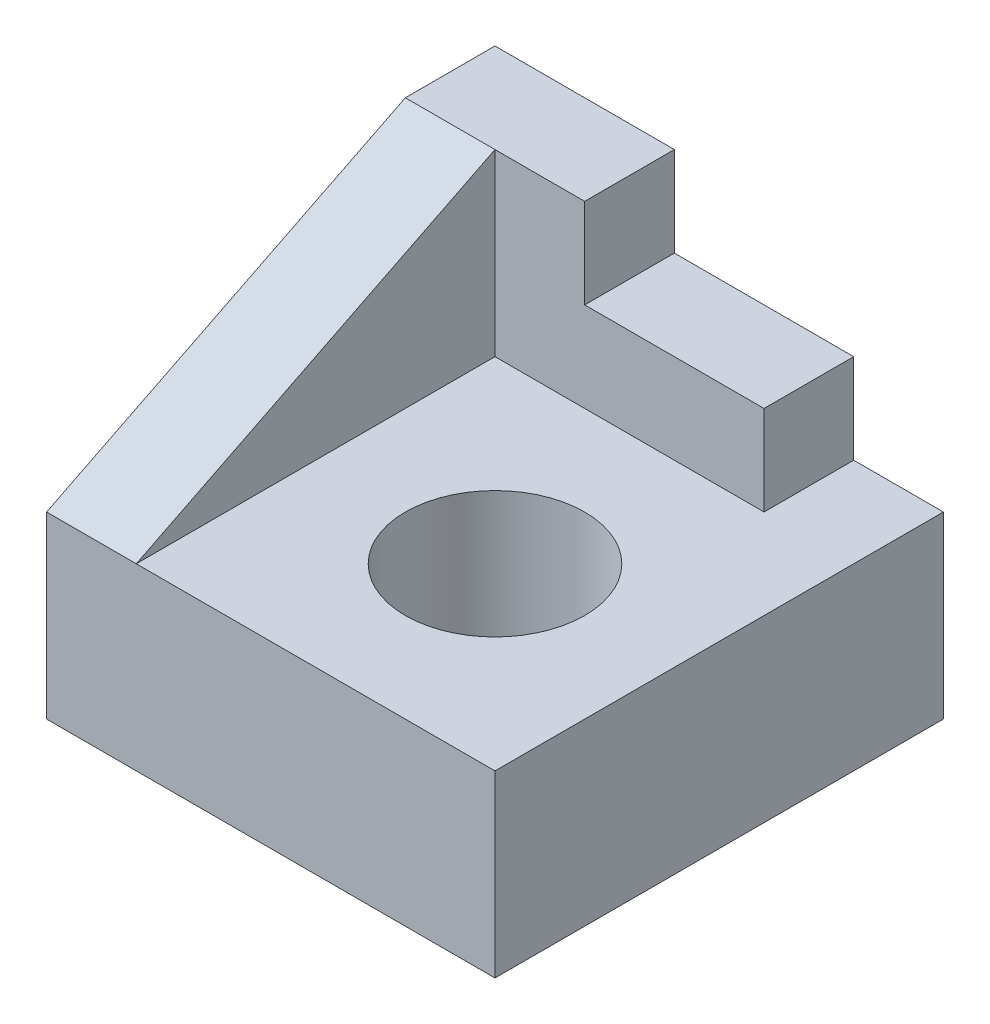
ISO-10303-21;
HEADER;
FILE_DESCRIPTION(('STEP AP214'),'2;1');
FILE_NAME('part.step','',(''),(''),'','','');
FILE_SCHEMA(('AUTOMOTIVE_DESIGN { 1 0 10303 214 1 1 1 1 }'));
ENDSEC;
DATA;
#1=APPLICATION_CONTEXT('core data for automotive mechanical design processes');
#2=APPLICATION_PROTOCOL_DEFINITION('international standard','automotive_design',2000,#1);
#3=PRODUCT_CONTEXT('',#1,'mechanical');
#4=PRODUCT('Part','Part','',(#3));
#5=PRODUCT_RELATED_PRODUCT_CATEGORY('part','',(#4));
#6=PRODUCT_DEFINITION_FORMATION('','',#4);
#7=PRODUCT_DEFINITION_CONTEXT('part definition',#1,'design');
#8=PRODUCT_DEFINITION('design','',#6,#7);
#9=PRODUCT_DEFINITION_SHAPE('','',#8);
#10=(LENGTH_UNIT() NAMED_UNIT(*) SI_UNIT(.MILLI.,.METRE.));
#11=(NAMED_UNIT(*) PLANE_ANGLE_UNIT() SI_UNIT($,.RADIAN.));
#12=(NAMED_UNIT(*) SI_UNIT($,.STERADIAN.) SOLID_ANGLE_UNIT());
#13=UNCERTAINTY_MEASURE_WITH_UNIT(LENGTH_MEASURE(1.E-05),#10,'distance_accuracy_value','');
#14=(GEOMETRIC_REPRESENTATION_CONTEXT(3) GLOBAL_UNCERTAINTY_ASSIGNED_CONTEXT((#13)) GLOBAL_UNIT_ASSIGNED_CONTEXT((#10,
#11,#12)) REPRESENTATION_CONTEXT('',''));
#15=CARTESIAN_POINT('',(0.,0.,0.));
#16=DIRECTION('',(0.,0.,1.));
#17=DIRECTION('',(1.,0.,0.));
#18=AXIS2_PLACEMENT_3D('',#15,#16,#17);
#19=CARTESIAN_POINT('',(0.,10.,10.));
#20=DIRECTION('',(0.,0.,-1.));
#21=DIRECTION('',(-1.,0.,0.));
#22=AXIS2_PLACEMENT_3D('',#19,#20,#21);
#23=PLANE('',#22);
#24=DIRECTION('',(1.,0.,0.));
#25=VECTOR('',#24,1.);
#26=CARTESIAN_POINT('',(0.,10.,10.));
#27=LINE('',#26,#25);
#28=CARTESIAN_POINT('',(-10.,10.,10.));
#29=VERTEX_POINT('',#28);
#30=CARTESIAN_POINT('',(10.,10.,10.));
#31=VERTEX_POINT('',#30);
#32=EDGE_CURVE('E138',#29,#31,#27,.T.);
#33=ORIENTED_EDGE('',*,*,#32,.F.);
#34=DIRECTION('',(1.,0.,0.));
#35=VECTOR('',#34,1.);
#36=CARTESIAN_POINT('',(-30.,10.,10.));
#37=LINE('',#36,#35);
#38=CARTESIAN_POINT('',(-15.,10.,10.));
#39=VERTEX_POINT('',#38);
#40=EDGE_CURVE('E119',#39,#29,#37,.T.);
#41=ORIENTED_EDGE('',*,*,#40,.F.);
#42=DIRECTION('',(0.,-1.,0.));
#43=VECTOR('',#42,1.);
#44=CARTESIAN_POINT('',(-15.,20.,10.));
#45=LINE('',#44,#43);
#46=CARTESIAN_POINT('',(-15.,0.,10.));
#47=VERTEX_POINT('',#46);
#48=EDGE_CURVE('E194',#39,#47,#45,.T.);
#49=ORIENTED_EDGE('',*,*,#48,.T.);
#50=DIRECTION('',(1.,0.,0.));
#51=VECTOR('',#50,1.);
#52=CARTESIAN_POINT('',(0.,0.,10.));
#53=LINE('',#52,#51);
#54=CARTESIAN_POINT('',(10.,0.,10.));
#55=VERTEX_POINT('',#54);
#56=EDGE_CURVE('E158',#47,#55,#53,.T.);
#57=ORIENTED_EDGE('',*,*,#56,.T.);
#58=DIRECTION('',(0.,-1.,0.));
#59=VECTOR('',#58,1.);
#60=CARTESIAN_POINT('',(10.,10.,10.));
#61=LINE('',#60,#59);
#62=EDGE_CURVE('E48',#31,#55,#61,.T.);
#63=ORIENTED_EDGE('',*,*,#62,.F.);
#64=EDGE_LOOP('',(#33,#41,#49,#57,#63));
#65=FACE_BOUND('',#64,.T.);
#66=ADVANCED_FACE('F39',(#65),#23,.F.);
#67=CARTESIAN_POINT('',(10.,10.,0.));
#68=DIRECTION('',(1.,0.,0.));
#69=DIRECTION('',(0.,0.,-1.));
#70=AXIS2_PLACEMENT_3D('',#67,#68,#69);
#71=PLANE('',#70);
#72=DIRECTION('',(0.,0.,1.));
#73=VECTOR('',#72,1.);
#74=CARTESIAN_POINT('',(10.,0.,0.));
#75=LINE('',#74,#73);
#76=CARTESIAN_POINT('',(10.,0.,-15.));
#77=VERTEX_POINT('',#76);
#78=EDGE_CURVE('E161',#77,#55,#75,.T.);
#79=ORIENTED_EDGE('',*,*,#78,.F.);
#80=DIRECTION('',(0.,-1.,0.));
#81=VECTOR('',#80,1.);
#82=CARTESIAN_POINT('',(10.,10.,-15.));
#83=LINE('',#82,#81);
#84=CARTESIAN_POINT('',(10.,10.,-15.));
#85=VERTEX_POINT('',#84);
#86=EDGE_CURVE('E56',#85,#77,#83,.T.);
#87=ORIENTED_EDGE('',*,*,#86,.F.);
#88=DIRECTION('',(0.,0.,1.));
#89=VECTOR('',#88,1.);
#90=CARTESIAN_POINT('',(10.,10.,0.));
#91=LINE('',#90,#89);
#92=EDGE_CURVE('E140',#85,#31,#91,.T.);
#93=ORIENTED_EDGE('',*,*,#92,.T.);
#94=ORIENTED_EDGE('',*,*,#62,.T.);
#95=EDGE_LOOP('',(#79,#87,#93,#94));
#96=FACE_BOUND('',#95,.T.);
#97=ADVANCED_FACE('F172',(#96),#71,.T.);
#98=CARTESIAN_POINT('',(0.,10.,-15.));
#99=DIRECTION('',(0.,0.,-1.));
#100=DIRECTION('',(-1.,0.,0.));
#101=AXIS2_PLACEMENT_3D('',#98,#99,#100);
#102=PLANE('',#101);
#103=DIRECTION('',(1.,0.,0.));
#104=VECTOR('',#103,1.);
#105=CARTESIAN_POINT('',(0.,0.,-15.));
#106=LINE('',#105,#104);
#107=CARTESIAN_POINT('',(-15.,0.,-15.));
#108=VERTEX_POINT('',#107);
#109=EDGE_CURVE('E164',#108,#77,#106,.T.);
#110=ORIENTED_EDGE('',*,*,#109,.F.);
#111=DIRECTION('',(0.,-1.,0.));
#112=VECTOR('',#111,1.);
#113=CARTESIAN_POINT('',(-15.,20.,-15.));
#114=LINE('',#113,#112);
#115=CARTESIAN_POINT('',(-15.,20.,-15.));
#116=VERTEX_POINT('',#115);
#117=EDGE_CURVE('E196',#116,#108,#114,.T.);
#118=ORIENTED_EDGE('',*,*,#117,.F.);
#119=DIRECTION('',(1.,0.,0.));
#120=VECTOR('',#119,1.);
#121=CARTESIAN_POINT('',(0.,20.,-15.));
#122=LINE('',#121,#120);
#123=CARTESIAN_POINT('',(-5.,20.,-15.));
#124=VERTEX_POINT('',#123);
#125=EDGE_CURVE('E184',#116,#124,#122,.T.);
#126=ORIENTED_EDGE('',*,*,#125,.T.);
#127=DIRECTION('',(0.,-1.,0.));
#128=VECTOR('',#127,1.);
#129=CARTESIAN_POINT('',(-5.,20.,-15.));
#130=LINE('',#129,#128);
#131=CARTESIAN_POINT('',(-5.,15.,-15.));
#132=VERTEX_POINT('',#131);
#133=EDGE_CURVE('E198',#124,#132,#130,.T.);
#134=ORIENTED_EDGE('',*,*,#133,.T.);
#135=DIRECTION('',(1.,0.,0.));
#136=VECTOR('',#135,1.);
#137=CARTESIAN_POINT('',(0.,15.,-15.));
#138=LINE('',#137,#136);
#139=CARTESIAN_POINT('',(5.,15.,-15.));
#140=VERTEX_POINT('',#139);
#141=EDGE_CURVE('E206',#132,#140,#138,.T.);
#142=ORIENTED_EDGE('',*,*,#141,.T.);
#143=DIRECTION('',(0.,-1.,0.));
#144=VECTOR('',#143,1.);
#145=CARTESIAN_POINT('',(5.,15.,-15.));
#146=LINE('',#145,#144);
#147=CARTESIAN_POINT('',(5.,10.,-15.));
#148=VERTEX_POINT('',#147);
#149=EDGE_CURVE('E212',#140,#148,#146,.T.);
#150=ORIENTED_EDGE('',*,*,#149,.T.);
#151=DIRECTION('',(1.,0.,0.));
#152=VECTOR('',#151,1.);
#153=CARTESIAN_POINT('',(0.,10.,-15.));
#154=LINE('',#153,#152);
#155=EDGE_CURVE('E150',#148,#85,#154,.T.);
#156=ORIENTED_EDGE('',*,*,#155,.T.);
#157=ORIENTED_EDGE('',*,*,#86,.T.);
#158=EDGE_LOOP('',(#110,#118,#126,#134,#142,#150,#156,#157));
#159=FACE_BOUND('',#158,.T.);
#160=ADVANCED_FACE('F168',(#159),#102,.T.);
#161=CARTESIAN_POINT('',(0.,10.,0.));
#162=DIRECTION('',(0.,-1.,0.));
#163=DIRECTION('',(0.,0.,-1.));
#164=AXIS2_PLACEMENT_3D('',#161,#162,#163);
#165=CYLINDRICAL_SURFACE('',#164,5.);
#166=CARTESIAN_POINT('',(0.,10.,0.));
#167=DIRECTION('',(0.,1.,0.));
#168=DIRECTION('',(0.,0.,1.));
#169=AXIS2_PLACEMENT_3D('',#166,#167,#168);
#170=CIRCLE('',#169,5.);
#171=CARTESIAN_POINT('',(0.,10.,5.));
#172=VERTEX_POINT('',#171);
#173=EDGE_CURVE('E145',#172,#172,#170,.T.);
#174=ORIENTED_EDGE('',*,*,#173,.T.);
#175=EDGE_LOOP('',(#174));
#176=FACE_BOUND('',#175,.T.);
#177=CARTESIAN_POINT('',(0.,0.,0.));
#178=DIRECTION('',(0.,1.,0.));
#179=DIRECTION('',(0.,0.,1.));
#180=AXIS2_PLACEMENT_3D('',#177,#178,#179);
#181=CIRCLE('',#180,5.);
#182=CARTESIAN_POINT('',(0.,0.,5.));
#183=VERTEX_POINT('',#182);
#184=EDGE_CURVE('E155',#183,#183,#181,.T.);
#185=ORIENTED_EDGE('',*,*,#184,.F.);
#186=EDGE_LOOP('',(#185));
#187=FACE_BOUND('',#186,.T.);
#188=ADVANCED_FACE('F41',(#176,#187),#165,.F.);
#189=CARTESIAN_POINT('',(0.,10.,0.));
#190=DIRECTION('',(0.,1.,0.));
#191=DIRECTION('',(0.,0.,1.));
#192=AXIS2_PLACEMENT_3D('',#189,#190,#191);
#193=PLANE('',#192);
#194=ORIENTED_EDGE('',*,*,#173,.F.);
#195=EDGE_LOOP('',(#194));
#196=FACE_BOUND('',#195,.T.);
#197=DIRECTION('',(1.,0.,0.));
#198=VECTOR('',#197,1.);
#199=CARTESIAN_POINT('',(0.,10.,-10.));
#200=LINE('',#199,#198);
#201=CARTESIAN_POINT('',(-10.,10.,-10.));
#202=VERTEX_POINT('',#201);
#203=CARTESIAN_POINT('',(5.,10.,-10.));
#204=VERTEX_POINT('',#203);
#205=EDGE_CURVE('E72',#202,#204,#200,.T.);
#206=ORIENTED_EDGE('',*,*,#205,.F.);
#207=DIRECTION('',(0.,0.,1.));
#208=VECTOR('',#207,1.);
#209=CARTESIAN_POINT('',(-10.,10.,0.));
#210=LINE('',#209,#208);
#211=EDGE_CURVE('E134',#202,#29,#210,.T.);
#212=ORIENTED_EDGE('',*,*,#211,.T.);
#213=ORIENTED_EDGE('',*,*,#32,.T.);
#214=ORIENTED_EDGE('',*,*,#92,.F.);
#215=ORIENTED_EDGE('',*,*,#155,.F.);
#216=DIRECTION('',(0.,0.,-1.));
#217=VECTOR('',#216,1.);
#218=CARTESIAN_POINT('',(5.,10.,0.));
#219=LINE('',#218,#217);
#220=EDGE_CURVE('E153',#204,#148,#219,.T.);
#221=ORIENTED_EDGE('',*,*,#220,.F.);
#222=EDGE_LOOP('',(#206,#212,#213,#214,#215,#221));
#223=FACE_BOUND('',#222,.T.);
#224=ADVANCED_FACE('F142',(#196,#223),#193,.T.);
#225=CARTESIAN_POINT('',(0.,0.,0.));
#226=DIRECTION('',(0.,1.,0.));
#227=DIRECTION('',(0.,0.,1.));
#228=AXIS2_PLACEMENT_3D('',#225,#226,#227);
#229=PLANE('',#228);
#230=ORIENTED_EDGE('',*,*,#56,.F.);
#231=DIRECTION('',(0.,0.,1.));
#232=VECTOR('',#231,1.);
#233=CARTESIAN_POINT('',(-15.,0.,0.));
#234=LINE('',#233,#232);
#235=EDGE_CURVE('E179',#108,#47,#234,.T.);
#236=ORIENTED_EDGE('',*,*,#235,.F.);
#237=ORIENTED_EDGE('',*,*,#109,.T.);
#238=ORIENTED_EDGE('',*,*,#78,.T.);
#239=EDGE_LOOP('',(#230,#236,#237,#238));
#240=FACE_BOUND('',#239,.T.);
#241=ORIENTED_EDGE('',*,*,#184,.T.);
#242=EDGE_LOOP('',(#241));
#243=FACE_BOUND('',#242,.T.);
#244=ADVANCED_FACE('F176',(#240,#243),#229,.F.);
#245=CARTESIAN_POINT('',(0.,15.,-10.));
#246=DIRECTION('',(0.,0.,-1.));
#247=DIRECTION('',(-1.,0.,0.));
#248=AXIS2_PLACEMENT_3D('',#245,#246,#247);
#249=PLANE('',#248);
#250=ORIENTED_EDGE('',*,*,#205,.T.);
#251=DIRECTION('',(0.,-1.,0.));
#252=VECTOR('',#251,1.);
#253=CARTESIAN_POINT('',(5.,15.,-10.));
#254=LINE('',#253,#252);
#255=CARTESIAN_POINT('',(5.,15.,-10.));
#256=VERTEX_POINT('',#255);
#257=EDGE_CURVE('E159',#256,#204,#254,.T.);
#258=ORIENTED_EDGE('',*,*,#257,.F.);
#259=DIRECTION('',(1.,0.,0.));
#260=VECTOR('',#259,1.);
#261=CARTESIAN_POINT('',(0.,15.,-10.));
#262=LINE('',#261,#260);
#263=CARTESIAN_POINT('',(-5.,15.,-10.));
#264=VERTEX_POINT('',#263);
#265=EDGE_CURVE('E201',#264,#256,#262,.T.);
#266=ORIENTED_EDGE('',*,*,#265,.F.);
#267=DIRECTION('',(0.,-1.,0.));
#268=VECTOR('',#267,1.);
#269=CARTESIAN_POINT('',(-5.,20.,-10.));
#270=LINE('',#269,#268);
#271=CARTESIAN_POINT('',(-5.,20.,-10.));
#272=VERTEX_POINT('',#271);
#273=EDGE_CURVE('E191',#272,#264,#270,.T.);
#274=ORIENTED_EDGE('',*,*,#273,.F.);
#275=DIRECTION('',(1.,0.,0.));
#276=VECTOR('',#275,1.);
#277=CARTESIAN_POINT('',(0.,20.,-10.));
#278=LINE('',#277,#276);
#279=CARTESIAN_POINT('',(-10.,20.,-10.));
#280=VERTEX_POINT('',#279);
#281=EDGE_CURVE('E189',#280,#272,#278,.T.);
#282=ORIENTED_EDGE('',*,*,#281,.F.);
#283=DIRECTION('',(0.,-1.,0.));
#284=VECTOR('',#283,1.);
#285=CARTESIAN_POINT('',(-10.,20.,-10.));
#286=LINE('',#285,#284);
#287=EDGE_CURVE('E135',#280,#202,#286,.T.);
#288=ORIENTED_EDGE('',*,*,#287,.T.);
#289=EDGE_LOOP('',(#250,#258,#266,#274,#282,#288));
#290=FACE_BOUND('',#289,.T.);
#291=ADVANCED_FACE('F225',(#290),#249,.F.);
#292=CARTESIAN_POINT('',(5.,15.,0.));
#293=DIRECTION('',(-1.,0.,0.));
#294=DIRECTION('',(0.,0.,1.));
#295=AXIS2_PLACEMENT_3D('',#292,#293,#294);
#296=PLANE('',#295);
#297=ORIENTED_EDGE('',*,*,#220,.T.);
#298=ORIENTED_EDGE('',*,*,#149,.F.);
#299=DIRECTION('',(0.,0.,-1.));
#300=VECTOR('',#299,1.);
#301=CARTESIAN_POINT('',(5.,15.,0.));
#302=LINE('',#301,#300);
#303=EDGE_CURVE('E204',#256,#140,#302,.T.);
#304=ORIENTED_EDGE('',*,*,#303,.F.);
#305=ORIENTED_EDGE('',*,*,#257,.T.);
#306=EDGE_LOOP('',(#297,#298,#304,#305));
#307=FACE_BOUND('',#306,.T.);
#308=ADVANCED_FACE('F253',(#307),#296,.F.);
#309=CARTESIAN_POINT('',(0.,15.,0.));
#310=DIRECTION('',(0.,1.,0.));
#311=DIRECTION('',(0.,0.,1.));
#312=AXIS2_PLACEMENT_3D('',#309,#310,#311);
#313=PLANE('',#312);
#314=ORIENTED_EDGE('',*,*,#265,.T.);
#315=ORIENTED_EDGE('',*,*,#303,.T.);
#316=ORIENTED_EDGE('',*,*,#141,.F.);
#317=DIRECTION('',(0.,0.,1.));
#318=VECTOR('',#317,1.);
#319=CARTESIAN_POINT('',(-5.,15.,0.));
#320=LINE('',#319,#318);
#321=EDGE_CURVE('E209',#132,#264,#320,.T.);
#322=ORIENTED_EDGE('',*,*,#321,.T.);
#323=EDGE_LOOP('',(#314,#315,#316,#322));
#324=FACE_BOUND('',#323,.T.);
#325=ADVANCED_FACE('F257',(#324),#313,.T.);
#326=CARTESIAN_POINT('',(-5.,20.,0.));
#327=DIRECTION('',(1.,0.,0.));
#328=DIRECTION('',(0.,0.,-1.));
#329=AXIS2_PLACEMENT_3D('',#326,#327,#328);
#330=PLANE('',#329);
#331=ORIENTED_EDGE('',*,*,#273,.T.);
#332=ORIENTED_EDGE('',*,*,#321,.F.);
#333=ORIENTED_EDGE('',*,*,#133,.F.);
#334=DIRECTION('',(0.,0.,1.));
#335=VECTOR('',#334,1.);
#336=CARTESIAN_POINT('',(-5.,20.,0.));
#337=LINE('',#336,#335);
#338=EDGE_CURVE('E181',#124,#272,#337,.T.);
#339=ORIENTED_EDGE('',*,*,#338,.T.);
#340=EDGE_LOOP('',(#331,#332,#333,#339));
#341=FACE_BOUND('',#340,.T.);
#342=ADVANCED_FACE('F272',(#341),#330,.T.);
#343=CARTESIAN_POINT('',(-15.,20.,0.));
#344=DIRECTION('',(1.,0.,0.));
#345=DIRECTION('',(0.,0.,-1.));
#346=AXIS2_PLACEMENT_3D('',#343,#344,#345);
#347=PLANE('',#346);
#348=ORIENTED_EDGE('',*,*,#48,.F.);
#349=DIRECTION('',(0.,0.447213595499958,-0.894427190999916));
#350=VECTOR('',#349,1.);
#351=CARTESIAN_POINT('',(-15.,16.,-2.));
#352=LINE('',#351,#350);
#353=CARTESIAN_POINT('',(-15.,20.,-10.));
#354=VERTEX_POINT('',#353);
#355=EDGE_CURVE('E125',#39,#354,#352,.T.);
#356=ORIENTED_EDGE('',*,*,#355,.T.);
#357=DIRECTION('',(0.,0.,1.));
#358=VECTOR('',#357,1.);
#359=CARTESIAN_POINT('',(-15.,20.,0.));
#360=LINE('',#359,#358);
#361=EDGE_CURVE('E389',#116,#354,#360,.T.);
#362=ORIENTED_EDGE('',*,*,#361,.F.);
#363=ORIENTED_EDGE('',*,*,#117,.T.);
#364=ORIENTED_EDGE('',*,*,#235,.T.);
#365=EDGE_LOOP('',(#348,#356,#362,#363,#364));
#366=FACE_BOUND('',#365,.T.);
#367=ADVANCED_FACE('F279',(#366),#347,.F.);
#368=CARTESIAN_POINT('',(-10.,20.,0.));
#369=DIRECTION('',(1.,0.,0.));
#370=DIRECTION('',(0.,0.,-1.));
#371=AXIS2_PLACEMENT_3D('',#368,#369,#370);
#372=PLANE('',#371);
#373=DIRECTION('',(0.,0.447213595499958,-0.894427190999916));
#374=VECTOR('',#373,1.);
#375=CARTESIAN_POINT('',(-10.,10.,10.));
#376=LINE('',#375,#374);
#377=EDGE_CURVE('E122',#29,#280,#376,.T.);
#378=ORIENTED_EDGE('',*,*,#377,.F.);
#379=ORIENTED_EDGE('',*,*,#211,.F.);
#380=ORIENTED_EDGE('',*,*,#287,.F.);
#381=EDGE_LOOP('',(#378,#379,#380));
#382=FACE_BOUND('',#381,.T.);
#383=ADVANCED_FACE('F132',(#382),#372,.T.);
#384=CARTESIAN_POINT('',(0.,20.,0.));
#385=DIRECTION('',(0.,1.,0.));
#386=DIRECTION('',(0.,0.,1.));
#387=AXIS2_PLACEMENT_3D('',#384,#385,#386);
#388=PLANE('',#387);
#389=DIRECTION('',(-1.,0.,0.));
#390=VECTOR('',#389,1.);
#391=CARTESIAN_POINT('',(0.,20.,-10.));
#392=LINE('',#391,#390);
#393=EDGE_CURVE('E11',#280,#354,#392,.T.);
#394=ORIENTED_EDGE('',*,*,#393,.F.);
#395=ORIENTED_EDGE('',*,*,#281,.T.);
#396=ORIENTED_EDGE('',*,*,#338,.F.);
#397=ORIENTED_EDGE('',*,*,#125,.F.);
#398=ORIENTED_EDGE('',*,*,#361,.T.);
#399=EDGE_LOOP('',(#394,#395,#396,#397,#398));
#400=FACE_BOUND('',#399,.T.);
#401=ADVANCED_FACE('F293',(#400),#388,.T.);
#402=CARTESIAN_POINT('',(-30.,10.,10.));
#403=DIRECTION('',(0.,-0.894427190999916,-0.447213595499958));
#404=DIRECTION('',(0.,0.447213595499958,-0.894427190999916));
#405=AXIS2_PLACEMENT_3D('',#402,#403,#404);
#406=PLANE('',#405);
#407=ORIENTED_EDGE('',*,*,#40,.T.);
#408=ORIENTED_EDGE('',*,*,#377,.T.);
#409=ORIENTED_EDGE('',*,*,#393,.T.);
#410=ORIENTED_EDGE('',*,*,#355,.F.);
#411=EDGE_LOOP('',(#407,#408,#409,#410));
#412=FACE_BOUND('',#411,.T.);
#413=ADVANCED_FACE('F121',(#412),#406,.F.);
#414=CLOSED_SHELL('',(#66,#97,#160,#188,#224,#244,#291,#308,#325,#342,#367,#383,#401,#413));
#415=MANIFOLD_SOLID_BREP('B2',#414);
#416=ADVANCED_BREP_SHAPE_REPRESENTATION('',(#18,#415),#14);
#417=SHAPE_DEFINITION_REPRESENTATION(#9,#416);
ENDSEC;
END-ISO-10303-21;
